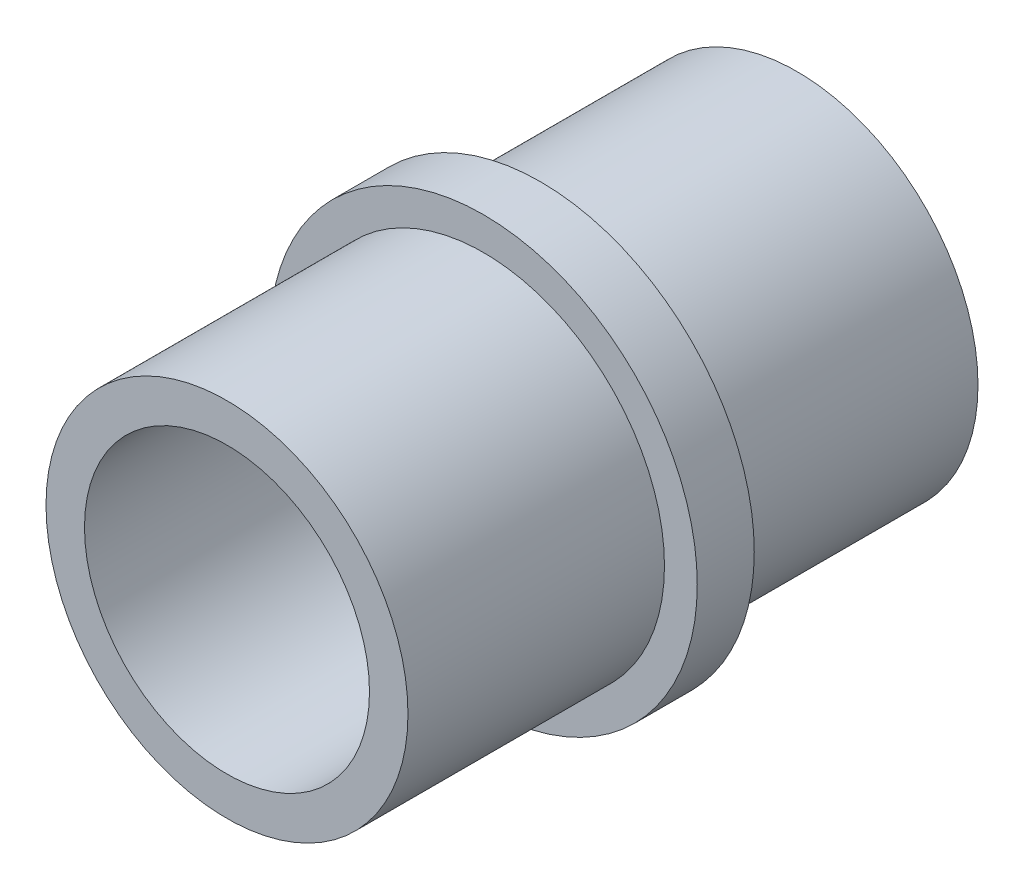
ISO-10303-21;
HEADER;
FILE_DESCRIPTION(('STEP AP214'),'2;1');
FILE_NAME('part.step','',(''),(''),'','','');
FILE_SCHEMA(('AUTOMOTIVE_DESIGN { 1 0 10303 214 1 1 1 1 }'));
ENDSEC;
DATA;
#1=APPLICATION_CONTEXT('core data for automotive mechanical design processes');
#2=APPLICATION_PROTOCOL_DEFINITION('international standard','automotive_design',2000,#1);
#3=PRODUCT_CONTEXT('',#1,'mechanical');
#4=PRODUCT('Part','Part','',(#3));
#5=PRODUCT_RELATED_PRODUCT_CATEGORY('part','',(#4));
#6=PRODUCT_DEFINITION_FORMATION('','',#4);
#7=PRODUCT_DEFINITION_CONTEXT('part definition',#1,'design');
#8=PRODUCT_DEFINITION('design','',#6,#7);
#9=PRODUCT_DEFINITION_SHAPE('','',#8);
#10=(LENGTH_UNIT() NAMED_UNIT(*) SI_UNIT(.MILLI.,.METRE.));
#11=(NAMED_UNIT(*) PLANE_ANGLE_UNIT() SI_UNIT($,.RADIAN.));
#12=(NAMED_UNIT(*) SI_UNIT($,.STERADIAN.) SOLID_ANGLE_UNIT());
#13=UNCERTAINTY_MEASURE_WITH_UNIT(LENGTH_MEASURE(1.E-05),#10,'distance_accuracy_value','');
#14=(GEOMETRIC_REPRESENTATION_CONTEXT(3) GLOBAL_UNCERTAINTY_ASSIGNED_CONTEXT((#13)) GLOBAL_UNIT_ASSIGNED_CONTEXT((#10,
#11,#12)) REPRESENTATION_CONTEXT('',''));
#15=CARTESIAN_POINT('',(0.,0.,0.));
#16=DIRECTION('',(0.,0.,1.));
#17=DIRECTION('',(1.,0.,0.));
#18=AXIS2_PLACEMENT_3D('',#15,#16,#17);
#19=CARTESIAN_POINT('',(0.,0.,10.));
#20=DIRECTION('',(0.,0.,-1.));
#21=DIRECTION('',(-1.,0.,0.));
#22=AXIS2_PLACEMENT_3D('',#19,#20,#21);
#23=CYLINDRICAL_SURFACE('',#22,6.35);
#24=CARTESIAN_POINT('',(0.,0.,-10.));
#25=DIRECTION('',(0.,0.,1.));
#26=DIRECTION('',(1.,0.,0.));
#27=AXIS2_PLACEMENT_3D('',#24,#25,#26);
#28=CIRCLE('',#27,6.35);
#29=CARTESIAN_POINT('',(6.35,0.,-10.));
#30=VERTEX_POINT('',#29);
#31=EDGE_CURVE('E45',#30,#30,#28,.T.);
#32=ORIENTED_EDGE('',*,*,#31,.T.);
#33=EDGE_LOOP('',(#32));
#34=FACE_BOUND('',#33,.T.);
#35=CARTESIAN_POINT('',(0.,0.,-0.999999999999999));
#36=DIRECTION('',(0.,0.,1.));
#37=DIRECTION('',(1.,0.,0.));
#38=AXIS2_PLACEMENT_3D('',#35,#36,#37);
#39=CIRCLE('',#38,6.35);
#40=CARTESIAN_POINT('',(6.35,0.,-0.999999999999999));
#41=VERTEX_POINT('',#40);
#42=EDGE_CURVE('E10',#41,#41,#39,.T.);
#43=ORIENTED_EDGE('',*,*,#42,.F.);
#44=EDGE_LOOP('',(#43));
#45=FACE_BOUND('',#44,.T.);
#46=ADVANCED_FACE('F34',(#34,#45),#23,.T.);
#47=CARTESIAN_POINT('',(0.,0.,10.));
#48=DIRECTION('',(0.,0.,1.));
#49=DIRECTION('',(1.,0.,0.));
#50=AXIS2_PLACEMENT_3D('',#47,#48,#49);
#51=PLANE('',#50);
#52=CARTESIAN_POINT('',(0.,0.,10.));
#53=DIRECTION('',(0.,0.,1.));
#54=DIRECTION('',(1.,0.,0.));
#55=AXIS2_PLACEMENT_3D('',#52,#53,#54);
#56=CIRCLE('',#55,6.35);
#57=CARTESIAN_POINT('',(6.35,0.,10.));
#58=VERTEX_POINT('',#57);
#59=EDGE_CURVE('E41',#58,#58,#56,.T.);
#60=ORIENTED_EDGE('',*,*,#59,.T.);
#61=EDGE_LOOP('',(#60));
#62=FACE_BOUND('',#61,.T.);
#63=CARTESIAN_POINT('',(0.,0.,10.));
#64=DIRECTION('',(0.,0.,1.));
#65=DIRECTION('',(1.,0.,0.));
#66=AXIS2_PLACEMENT_3D('',#63,#64,#65);
#67=CIRCLE('',#66,5.);
#68=CARTESIAN_POINT('',(5.,0.,10.));
#69=VERTEX_POINT('',#68);
#70=EDGE_CURVE('E50',#69,#69,#67,.T.);
#71=ORIENTED_EDGE('',*,*,#70,.F.);
#72=EDGE_LOOP('',(#71));
#73=FACE_BOUND('',#72,.T.);
#74=ADVANCED_FACE('F85',(#62,#73),#51,.T.);
#75=CARTESIAN_POINT('',(0.,0.,-10.));
#76=DIRECTION('',(0.,0.,1.));
#77=DIRECTION('',(1.,0.,0.));
#78=AXIS2_PLACEMENT_3D('',#75,#76,#77);
#79=PLANE('',#78);
#80=ORIENTED_EDGE('',*,*,#31,.F.);
#81=EDGE_LOOP('',(#80));
#82=FACE_BOUND('',#81,.T.);
#83=CARTESIAN_POINT('',(0.,0.,-10.));
#84=DIRECTION('',(0.,0.,1.));
#85=DIRECTION('',(1.,0.,0.));
#86=AXIS2_PLACEMENT_3D('',#83,#84,#85);
#87=CIRCLE('',#86,5.);
#88=CARTESIAN_POINT('',(5.,0.,-10.));
#89=VERTEX_POINT('',#88);
#90=EDGE_CURVE('E52',#89,#89,#87,.T.);
#91=ORIENTED_EDGE('',*,*,#90,.T.);
#92=EDGE_LOOP('',(#91));
#93=FACE_BOUND('',#92,.T.);
#94=ADVANCED_FACE('F90',(#82,#93),#79,.F.);
#95=CARTESIAN_POINT('',(0.,0.,1.));
#96=DIRECTION('',(0.,0.,1.));
#97=DIRECTION('',(1.,0.,0.));
#98=AXIS2_PLACEMENT_3D('',#95,#96,#97);
#99=CIRCLE('',#98,6.35);
#100=CARTESIAN_POINT('',(6.35,0.,1.));
#101=VERTEX_POINT('',#100);
#102=EDGE_CURVE('E61',#101,#101,#99,.T.);
#103=ORIENTED_EDGE('',*,*,#102,.T.);
#104=EDGE_LOOP('',(#103));
#105=FACE_BOUND('',#104,.T.);
#106=ORIENTED_EDGE('',*,*,#59,.F.);
#107=EDGE_LOOP('',(#106));
#108=FACE_BOUND('',#107,.T.);
#109=ADVANCED_FACE('F36',(#105,#108),#23,.T.);
#110=CARTESIAN_POINT('',(0.,0.,10.));
#111=DIRECTION('',(0.,0.,-1.));
#112=DIRECTION('',(-1.,0.,0.));
#113=AXIS2_PLACEMENT_3D('',#110,#111,#112);
#114=CYLINDRICAL_SURFACE('',#113,5.);
#115=ORIENTED_EDGE('',*,*,#70,.T.);
#116=EDGE_LOOP('',(#115));
#117=FACE_BOUND('',#116,.T.);
#118=ORIENTED_EDGE('',*,*,#90,.F.);
#119=EDGE_LOOP('',(#118));
#120=FACE_BOUND('',#119,.T.);
#121=ADVANCED_FACE('F72',(#117,#120),#114,.F.);
#122=CARTESIAN_POINT('',(0.,0.,1.));
#123=DIRECTION('',(0.,0.,1.));
#124=DIRECTION('',(1.,0.,0.));
#125=AXIS2_PLACEMENT_3D('',#122,#123,#124);
#126=PLANE('',#125);
#127=CARTESIAN_POINT('',(0.,0.,1.));
#128=DIRECTION('',(0.,0.,1.));
#129=DIRECTION('',(1.,0.,0.));
#130=AXIS2_PLACEMENT_3D('',#127,#128,#129);
#131=CIRCLE('',#130,7.5);
#132=CARTESIAN_POINT('',(7.5,0.,1.));
#133=VERTEX_POINT('',#132);
#134=EDGE_CURVE('E55',#133,#133,#131,.T.);
#135=ORIENTED_EDGE('',*,*,#134,.T.);
#136=EDGE_LOOP('',(#135));
#137=FACE_BOUND('',#136,.T.);
#138=ORIENTED_EDGE('',*,*,#102,.F.);
#139=EDGE_LOOP('',(#138));
#140=FACE_BOUND('',#139,.T.);
#141=ADVANCED_FACE('F69',(#137,#140),#126,.T.);
#142=CARTESIAN_POINT('',(0.,0.,-1.));
#143=DIRECTION('',(0.,0.,1.));
#144=DIRECTION('',(1.,0.,0.));
#145=AXIS2_PLACEMENT_3D('',#142,#143,#144);
#146=PLANE('',#145);
#147=CARTESIAN_POINT('',(0.,0.,-1.));
#148=DIRECTION('',(0.,0.,1.));
#149=DIRECTION('',(1.,0.,0.));
#150=AXIS2_PLACEMENT_3D('',#147,#148,#149);
#151=CIRCLE('',#150,7.5);
#152=CARTESIAN_POINT('',(7.5,0.,-1.));
#153=VERTEX_POINT('',#152);
#154=EDGE_CURVE('E58',#153,#153,#151,.T.);
#155=ORIENTED_EDGE('',*,*,#154,.F.);
#156=EDGE_LOOP('',(#155));
#157=FACE_BOUND('',#156,.T.);
#158=ORIENTED_EDGE('',*,*,#42,.T.);
#159=EDGE_LOOP('',(#158));
#160=FACE_BOUND('',#159,.T.);
#161=ADVANCED_FACE('F71',(#157,#160),#146,.F.);
#162=CARTESIAN_POINT('',(0.,0.,1.));
#163=DIRECTION('',(0.,0.,-1.));
#164=DIRECTION('',(-1.,0.,0.));
#165=AXIS2_PLACEMENT_3D('',#162,#163,#164);
#166=CYLINDRICAL_SURFACE('',#165,7.5);
#167=ORIENTED_EDGE('',*,*,#134,.F.);
#168=EDGE_LOOP('',(#167));
#169=FACE_BOUND('',#168,.T.);
#170=ORIENTED_EDGE('',*,*,#154,.T.);
#171=EDGE_LOOP('',(#170));
#172=FACE_BOUND('',#171,.T.);
#173=ADVANCED_FACE('F79',(#169,#172),#166,.T.);
#174=CLOSED_SHELL('',(#46,#74,#94,#109,#121,#141,#161,#173));
#175=MANIFOLD_SOLID_BREP('B2',#174);
#176=ADVANCED_BREP_SHAPE_REPRESENTATION('',(#18,#175),#14);
#177=SHAPE_DEFINITION_REPRESENTATION(#9,#176);
ENDSEC;
END-ISO-10303-21;
